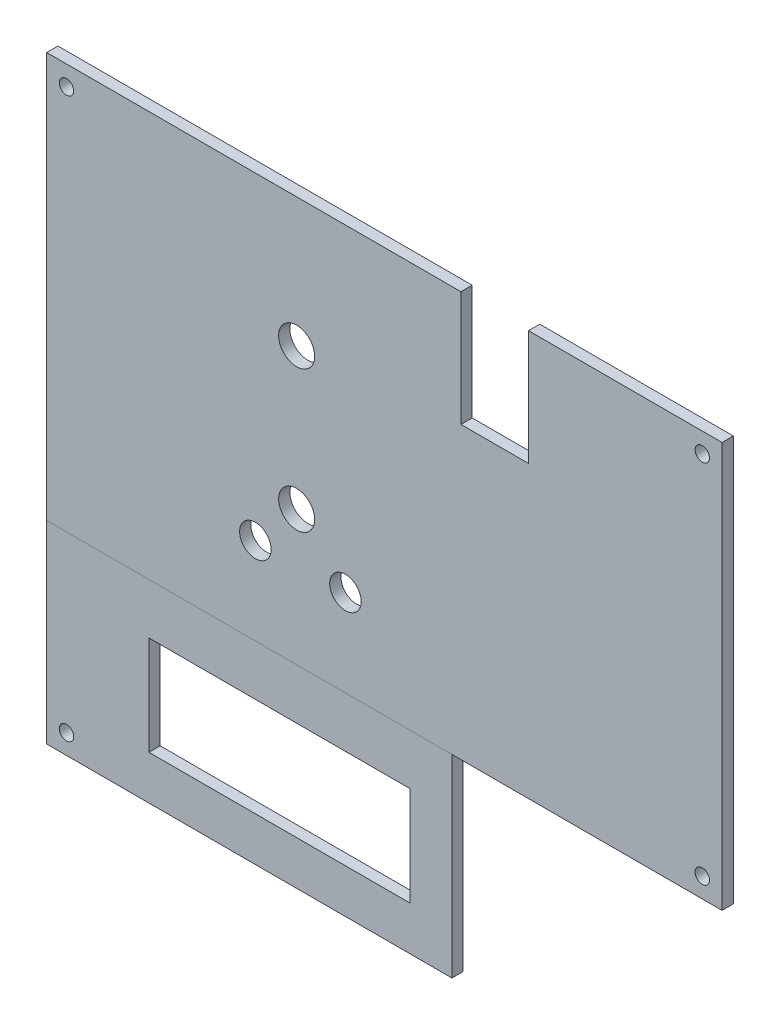
ISO-10303-21;
HEADER;
FILE_DESCRIPTION(('STEP AP214'),'2;1');
FILE_NAME('part.step','',(''),(''),'','','');
FILE_SCHEMA(('AUTOMOTIVE_DESIGN { 1 0 10303 214 1 1 1 1 }'));
ENDSEC;
DATA;
#1=APPLICATION_CONTEXT('core data for automotive mechanical design processes');
#2=APPLICATION_PROTOCOL_DEFINITION('international standard','automotive_design',2000,#1);
#3=PRODUCT_CONTEXT('',#1,'mechanical');
#4=PRODUCT('Part','Part','',(#3));
#5=PRODUCT_RELATED_PRODUCT_CATEGORY('part','',(#4));
#6=PRODUCT_DEFINITION_FORMATION('','',#4);
#7=PRODUCT_DEFINITION_CONTEXT('part definition',#1,'design');
#8=PRODUCT_DEFINITION('design','',#6,#7);
#9=PRODUCT_DEFINITION_SHAPE('','',#8);
#10=(LENGTH_UNIT() NAMED_UNIT(*) SI_UNIT(.MILLI.,.METRE.));
#11=(NAMED_UNIT(*) PLANE_ANGLE_UNIT() SI_UNIT($,.RADIAN.));
#12=(NAMED_UNIT(*) SI_UNIT($,.STERADIAN.) SOLID_ANGLE_UNIT());
#13=UNCERTAINTY_MEASURE_WITH_UNIT(LENGTH_MEASURE(1.E-05),#10,'distance_accuracy_value','');
#14=(GEOMETRIC_REPRESENTATION_CONTEXT(3) GLOBAL_UNCERTAINTY_ASSIGNED_CONTEXT((#13)) GLOBAL_UNIT_ASSIGNED_CONTEXT((#10,
#11,#12)) REPRESENTATION_CONTEXT('',''));
#15=CARTESIAN_POINT('',(0.,0.,0.));
#16=DIRECTION('',(0.,0.,1.));
#17=DIRECTION('',(1.,0.,0.));
#18=AXIS2_PLACEMENT_3D('',#15,#16,#17);
#19=CARTESIAN_POINT('',(-10.1855222715717,-9.29640000000001,0.));
#20=DIRECTION('',(-1.,0.,0.));
#21=DIRECTION('',(0.,-1.,0.));
#22=AXIS2_PLACEMENT_3D('',#19,#20,#21);
#23=PLANE('',#22);
#24=DIRECTION('',(0.,-1.,0.));
#25=VECTOR('',#24,1.);
#26=CARTESIAN_POINT('',(-10.1855222715717,-9.29640000000001,3.175));
#27=LINE('',#26,#25);
#28=CARTESIAN_POINT('',(-10.1855222715717,-9.29640000000001,3.175));
#29=VERTEX_POINT('',#28);
#30=CARTESIAN_POINT('',(-10.1855222715717,-63.9064,3.175));
#31=VERTEX_POINT('',#30);
#32=EDGE_CURVE('E153',#29,#31,#27,.T.);
#33=ORIENTED_EDGE('',*,*,#32,.F.);
#34=DIRECTION('',(0.,0.,1.));
#35=VECTOR('',#34,1.);
#36=CARTESIAN_POINT('',(-10.1855222715717,-9.29640000000001,0.));
#37=LINE('',#36,#35);
#38=CARTESIAN_POINT('',(-10.1855222715717,-9.29640000000001,0.));
#39=VERTEX_POINT('',#38);
#40=EDGE_CURVE('E12',#39,#29,#37,.T.);
#41=ORIENTED_EDGE('',*,*,#40,.F.);
#42=DIRECTION('',(0.,-1.,0.));
#43=VECTOR('',#42,1.);
#44=CARTESIAN_POINT('',(-10.1855222715717,-9.29640000000001,0.));
#45=LINE('',#44,#43);
#46=CARTESIAN_POINT('',(-10.1855222715717,-63.9064,0.));
#47=VERTEX_POINT('',#46);
#48=EDGE_CURVE('E157',#39,#47,#45,.T.);
#49=ORIENTED_EDGE('',*,*,#48,.T.);
#50=DIRECTION('',(0.,0.,1.));
#51=VECTOR('',#50,1.);
#52=CARTESIAN_POINT('',(-10.1855222715717,-63.9064,0.));
#53=LINE('',#52,#51);
#54=EDGE_CURVE('E54',#47,#31,#53,.T.);
#55=ORIENTED_EDGE('',*,*,#54,.T.);
#56=EDGE_LOOP('',(#33,#41,#49,#55));
#57=FACE_BOUND('',#56,.T.);
#58=ADVANCED_FACE('F51',(#57),#23,.T.);
#59=CARTESIAN_POINT('',(-10.1855222715717,-9.29640000000001,0.));
#60=DIRECTION('',(0.,1.,0.));
#61=DIRECTION('',(0.,0.,1.));
#62=AXIS2_PLACEMENT_3D('',#59,#60,#61);
#63=PLANE('',#62);
#64=DIRECTION('',(-1.,0.,0.));
#65=VECTOR('',#64,1.);
#66=CARTESIAN_POINT('',(-10.1855222715717,-9.29640000000001,3.175));
#67=LINE('',#66,#65);
#68=CARTESIAN_POINT('',(104.114477728428,-9.29640000000001,3.175));
#69=VERTEX_POINT('',#68);
#70=EDGE_CURVE('E161',#69,#29,#67,.T.);
#71=ORIENTED_EDGE('',*,*,#70,.F.);
#72=DIRECTION('',(0.,0.,1.));
#73=VECTOR('',#72,1.);
#74=CARTESIAN_POINT('',(104.114477728428,-9.29640000000001,0.));
#75=LINE('',#74,#73);
#76=CARTESIAN_POINT('',(104.114477728428,-9.29640000000001,0.));
#77=VERTEX_POINT('',#76);
#78=EDGE_CURVE('E59',#77,#69,#75,.T.);
#79=ORIENTED_EDGE('',*,*,#78,.F.);
#80=DIRECTION('',(-1.,0.,0.));
#81=VECTOR('',#80,1.);
#82=CARTESIAN_POINT('',(-10.1855222715717,-9.29640000000001,0.));
#83=LINE('',#82,#81);
#84=EDGE_CURVE('E167',#77,#39,#83,.T.);
#85=ORIENTED_EDGE('',*,*,#84,.T.);
#86=ORIENTED_EDGE('',*,*,#40,.T.);
#87=EDGE_LOOP('',(#71,#79,#85,#86));
#88=FACE_BOUND('',#87,.T.);
#89=ADVANCED_FACE('F193',(#88),#63,.T.);
#90=CARTESIAN_POINT('',(104.114477728428,-9.29640000000001,0.));
#91=DIRECTION('',(1.,0.,0.));
#92=DIRECTION('',(0.,0.,-1.));
#93=AXIS2_PLACEMENT_3D('',#90,#91,#92);
#94=PLANE('',#93);
#95=DIRECTION('',(0.,1.,0.));
#96=VECTOR('',#95,1.);
#97=CARTESIAN_POINT('',(104.114477728428,-9.29640000000001,3.175));
#98=LINE('',#97,#96);
#99=CARTESIAN_POINT('',(104.114477728428,-63.9064,3.175));
#100=VERTEX_POINT('',#99);
#101=EDGE_CURVE('E175',#100,#69,#98,.T.);
#102=ORIENTED_EDGE('',*,*,#101,.F.);
#103=DIRECTION('',(0.,0.,1.));
#104=VECTOR('',#103,1.);
#105=CARTESIAN_POINT('',(104.114477728428,-63.9064,0.));
#106=LINE('',#105,#104);
#107=CARTESIAN_POINT('',(104.114477728428,-63.9064,0.));
#108=VERTEX_POINT('',#107);
#109=EDGE_CURVE('E180',#108,#100,#106,.T.);
#110=ORIENTED_EDGE('',*,*,#109,.F.);
#111=DIRECTION('',(0.,1.,0.));
#112=VECTOR('',#111,1.);
#113=CARTESIAN_POINT('',(104.114477728428,-9.29640000000001,0.));
#114=LINE('',#113,#112);
#115=EDGE_CURVE('E164',#108,#77,#114,.T.);
#116=ORIENTED_EDGE('',*,*,#115,.T.);
#117=ORIENTED_EDGE('',*,*,#78,.T.);
#118=EDGE_LOOP('',(#102,#110,#116,#117));
#119=FACE_BOUND('',#118,.T.);
#120=ADVANCED_FACE('F197',(#119),#94,.T.);
#121=CARTESIAN_POINT('',(-10.1855222715717,-63.9064,0.));
#122=DIRECTION('',(0.,-1.,0.));
#123=DIRECTION('',(0.,0.,-1.));
#124=AXIS2_PLACEMENT_3D('',#121,#122,#123);
#125=PLANE('',#124);
#126=DIRECTION('',(1.,0.,0.));
#127=VECTOR('',#126,1.);
#128=CARTESIAN_POINT('',(-10.1855222715717,-63.9064,3.175));
#129=LINE('',#128,#127);
#130=EDGE_CURVE('E172',#31,#100,#129,.T.);
#131=ORIENTED_EDGE('',*,*,#130,.F.);
#132=ORIENTED_EDGE('',*,*,#54,.F.);
#133=DIRECTION('',(1.,0.,0.));
#134=VECTOR('',#133,1.);
#135=CARTESIAN_POINT('',(-10.1855222715717,-63.9064,0.));
#136=LINE('',#135,#134);
#137=EDGE_CURVE('E160',#47,#108,#136,.T.);
#138=ORIENTED_EDGE('',*,*,#137,.T.);
#139=ORIENTED_EDGE('',*,*,#109,.T.);
#140=EDGE_LOOP('',(#131,#132,#138,#139));
#141=FACE_BOUND('',#140,.T.);
#142=ADVANCED_FACE('F188',(#141),#125,.T.);
#143=CARTESIAN_POINT('',(0.,0.,0.));
#144=DIRECTION('',(0.,0.,1.));
#145=DIRECTION('',(1.,0.,0.));
#146=AXIS2_PLACEMENT_3D('',#143,#144,#145);
#147=PLANE('',#146);
#148=CARTESIAN_POINT('',(-4.59752227157175,-58.3184,0.));
#149=DIRECTION('',(0.,0.,1.));
#150=DIRECTION('',(1.,0.,0.));
#151=AXIS2_PLACEMENT_3D('',#148,#149,#150);
#152=CIRCLE('',#151,2.032);
#153=CARTESIAN_POINT('',(-2.56552227157176,-58.3184,0.));
#154=VERTEX_POINT('',#153);
#155=EDGE_CURVE('E147',#154,#154,#152,.T.);
#156=ORIENTED_EDGE('',*,*,#155,.T.);
#157=EDGE_LOOP('',(#156));
#158=FACE_BOUND('',#157,.T.);
#159=DIRECTION('',(-1.,0.,0.));
#160=VECTOR('',#159,1.);
#161=CARTESIAN_POINT('',(18.6411741669177,-23.5699071660705,0.));
#162=LINE('',#161,#160);
#163=CARTESIAN_POINT('',(92.3011741669177,-23.5699071660705,0.));
#164=VERTEX_POINT('',#163);
#165=CARTESIAN_POINT('',(18.6411741669177,-23.5699071660705,0.));
#166=VERTEX_POINT('',#165);
#167=EDGE_CURVE('E124',#164,#166,#162,.T.);
#168=ORIENTED_EDGE('',*,*,#167,.T.);
#169=DIRECTION('',(0.,-1.,0.));
#170=VECTOR('',#169,1.);
#171=CARTESIAN_POINT('',(18.6411741669177,-23.5699071660705,0.));
#172=LINE('',#171,#170);
#173=CARTESIAN_POINT('',(18.6411741669177,-51.5099071660705,0.));
#174=VERTEX_POINT('',#173);
#175=EDGE_CURVE('E118',#166,#174,#172,.T.);
#176=ORIENTED_EDGE('',*,*,#175,.T.);
#177=DIRECTION('',(1.,0.,0.));
#178=VECTOR('',#177,1.);
#179=CARTESIAN_POINT('',(18.6411741669177,-51.5099071660705,0.));
#180=LINE('',#179,#178);
#181=CARTESIAN_POINT('',(92.3011741669176,-51.5099071660705,0.));
#182=VERTEX_POINT('',#181);
#183=EDGE_CURVE('E127',#174,#182,#180,.T.);
#184=ORIENTED_EDGE('',*,*,#183,.T.);
#185=DIRECTION('',(0.,1.,0.));
#186=VECTOR('',#185,1.);
#187=CARTESIAN_POINT('',(92.3011741669177,-23.5699071660705,0.));
#188=LINE('',#187,#186);
#189=EDGE_CURVE('E67',#182,#164,#188,.T.);
#190=ORIENTED_EDGE('',*,*,#189,.T.);
#191=EDGE_LOOP('',(#168,#176,#184,#190));
#192=FACE_BOUND('',#191,.T.);
#193=ORIENTED_EDGE('',*,*,#48,.F.);
#194=ORIENTED_EDGE('',*,*,#84,.F.);
#195=ORIENTED_EDGE('',*,*,#115,.F.);
#196=ORIENTED_EDGE('',*,*,#137,.F.);
#197=EDGE_LOOP('',(#193,#194,#195,#196));
#198=FACE_BOUND('',#197,.T.);
#199=ADVANCED_FACE('F131',(#158,#192,#198),#147,.F.);
#200=CARTESIAN_POINT('',(0.,0.,3.175));
#201=DIRECTION('',(0.,0.,1.));
#202=DIRECTION('',(1.,0.,0.));
#203=AXIS2_PLACEMENT_3D('',#200,#201,#202);
#204=PLANE('',#203);
#205=CARTESIAN_POINT('',(-4.59752227157175,-58.3184,3.175));
#206=DIRECTION('',(0.,0.,1.));
#207=DIRECTION('',(1.,0.,0.));
#208=AXIS2_PLACEMENT_3D('',#205,#206,#207);
#209=CIRCLE('',#208,2.032);
#210=CARTESIAN_POINT('',(-2.56552227157176,-58.3184,3.175));
#211=VERTEX_POINT('',#210);
#212=EDGE_CURVE('E140',#211,#211,#209,.T.);
#213=ORIENTED_EDGE('',*,*,#212,.F.);
#214=EDGE_LOOP('',(#213));
#215=FACE_BOUND('',#214,.T.);
#216=DIRECTION('',(0.,-1.,0.));
#217=VECTOR('',#216,1.);
#218=CARTESIAN_POINT('',(18.6411741669177,-23.5699071660705,3.175));
#219=LINE('',#218,#217);
#220=CARTESIAN_POINT('',(18.6411741669177,-23.5699071660705,3.175));
#221=VERTEX_POINT('',#220);
#222=CARTESIAN_POINT('',(18.6411741669177,-51.5099071660705,3.175));
#223=VERTEX_POINT('',#222);
#224=EDGE_CURVE('E75',#221,#223,#219,.T.);
#225=ORIENTED_EDGE('',*,*,#224,.F.);
#226=DIRECTION('',(-1.,0.,0.));
#227=VECTOR('',#226,1.);
#228=CARTESIAN_POINT('',(18.6411741669177,-23.5699071660705,3.175));
#229=LINE('',#228,#227);
#230=CARTESIAN_POINT('',(92.3011741669177,-23.5699071660705,3.175));
#231=VERTEX_POINT('',#230);
#232=EDGE_CURVE('E134',#231,#221,#229,.T.);
#233=ORIENTED_EDGE('',*,*,#232,.F.);
#234=DIRECTION('',(0.,1.,0.));
#235=VECTOR('',#234,1.);
#236=CARTESIAN_POINT('',(92.3011741669177,-23.5699071660705,3.175));
#237=LINE('',#236,#235);
#238=CARTESIAN_POINT('',(92.3011741669176,-51.5099071660705,3.175));
#239=VERTEX_POINT('',#238);
#240=EDGE_CURVE('E137',#239,#231,#237,.T.);
#241=ORIENTED_EDGE('',*,*,#240,.F.);
#242=DIRECTION('',(1.,0.,0.));
#243=VECTOR('',#242,1.);
#244=CARTESIAN_POINT('',(18.6411741669177,-51.5099071660705,3.175));
#245=LINE('',#244,#243);
#246=EDGE_CURVE('E146',#223,#239,#245,.T.);
#247=ORIENTED_EDGE('',*,*,#246,.F.);
#248=EDGE_LOOP('',(#225,#233,#241,#247));
#249=FACE_BOUND('',#248,.T.);
#250=ORIENTED_EDGE('',*,*,#32,.T.);
#251=ORIENTED_EDGE('',*,*,#130,.T.);
#252=ORIENTED_EDGE('',*,*,#101,.T.);
#253=ORIENTED_EDGE('',*,*,#70,.T.);
#254=EDGE_LOOP('',(#250,#251,#252,#253));
#255=FACE_BOUND('',#254,.T.);
#256=ADVANCED_FACE('F190',(#215,#249,#255),#204,.T.);
#257=CARTESIAN_POINT('',(18.6411741669177,-23.5699071660705,0.));
#258=DIRECTION('',(-1.,0.,0.));
#259=DIRECTION('',(0.,0.,1.));
#260=AXIS2_PLACEMENT_3D('',#257,#258,#259);
#261=PLANE('',#260);
#262=ORIENTED_EDGE('',*,*,#224,.T.);
#263=DIRECTION('',(0.,0.,1.));
#264=VECTOR('',#263,1.);
#265=CARTESIAN_POINT('',(18.6411741669177,-51.5099071660705,0.));
#266=LINE('',#265,#264);
#267=EDGE_CURVE('E114',#174,#223,#266,.T.);
#268=ORIENTED_EDGE('',*,*,#267,.F.);
#269=ORIENTED_EDGE('',*,*,#175,.F.);
#270=DIRECTION('',(0.,0.,1.));
#271=VECTOR('',#270,1.);
#272=CARTESIAN_POINT('',(18.6411741669177,-23.5699071660705,0.));
#273=LINE('',#272,#271);
#274=EDGE_CURVE('E151',#166,#221,#273,.T.);
#275=ORIENTED_EDGE('',*,*,#274,.T.);
#276=EDGE_LOOP('',(#262,#268,#269,#275));
#277=FACE_BOUND('',#276,.T.);
#278=ADVANCED_FACE('F116',(#277),#261,.F.);
#279=CARTESIAN_POINT('',(18.6411741669177,-23.5699071660705,0.));
#280=DIRECTION('',(0.,1.,0.));
#281=DIRECTION('',(0.,0.,1.));
#282=AXIS2_PLACEMENT_3D('',#279,#280,#281);
#283=PLANE('',#282);
#284=ORIENTED_EDGE('',*,*,#232,.T.);
#285=ORIENTED_EDGE('',*,*,#274,.F.);
#286=ORIENTED_EDGE('',*,*,#167,.F.);
#287=DIRECTION('',(0.,0.,1.));
#288=VECTOR('',#287,1.);
#289=CARTESIAN_POINT('',(92.3011741669177,-23.5699071660705,0.));
#290=LINE('',#289,#288);
#291=EDGE_CURVE('E154',#164,#231,#290,.T.);
#292=ORIENTED_EDGE('',*,*,#291,.T.);
#293=EDGE_LOOP('',(#284,#285,#286,#292));
#294=FACE_BOUND('',#293,.T.);
#295=ADVANCED_FACE('F233',(#294),#283,.F.);
#296=CARTESIAN_POINT('',(92.3011741669177,-23.5699071660705,0.));
#297=DIRECTION('',(1.,0.,0.));
#298=DIRECTION('',(0.,1.,0.));
#299=AXIS2_PLACEMENT_3D('',#296,#297,#298);
#300=PLANE('',#299);
#301=ORIENTED_EDGE('',*,*,#240,.T.);
#302=ORIENTED_EDGE('',*,*,#291,.F.);
#303=ORIENTED_EDGE('',*,*,#189,.F.);
#304=DIRECTION('',(0.,0.,1.));
#305=VECTOR('',#304,1.);
#306=CARTESIAN_POINT('',(92.3011741669176,-51.5099071660705,0.));
#307=LINE('',#306,#305);
#308=EDGE_CURVE('E123',#182,#239,#307,.T.);
#309=ORIENTED_EDGE('',*,*,#308,.T.);
#310=EDGE_LOOP('',(#301,#302,#303,#309));
#311=FACE_BOUND('',#310,.T.);
#312=ADVANCED_FACE('F244',(#311),#300,.F.);
#313=CARTESIAN_POINT('',(18.6411741669177,-51.5099071660705,0.));
#314=DIRECTION('',(0.,-1.,0.));
#315=DIRECTION('',(1.,0.,0.));
#316=AXIS2_PLACEMENT_3D('',#313,#314,#315);
#317=PLANE('',#316);
#318=ORIENTED_EDGE('',*,*,#246,.T.);
#319=ORIENTED_EDGE('',*,*,#308,.F.);
#320=ORIENTED_EDGE('',*,*,#183,.F.);
#321=ORIENTED_EDGE('',*,*,#267,.T.);
#322=EDGE_LOOP('',(#318,#319,#320,#321));
#323=FACE_BOUND('',#322,.T.);
#324=ADVANCED_FACE('F128',(#323),#317,.F.);
#325=CARTESIAN_POINT('',(-4.59752227157175,-58.3184,0.));
#326=DIRECTION('',(0.,0.,1.));
#327=DIRECTION('',(1.,0.,0.));
#328=AXIS2_PLACEMENT_3D('',#325,#326,#327);
#329=CYLINDRICAL_SURFACE('',#328,2.032);
#330=ORIENTED_EDGE('',*,*,#155,.F.);
#331=EDGE_LOOP('',(#330));
#332=FACE_BOUND('',#331,.T.);
#333=ORIENTED_EDGE('',*,*,#212,.T.);
#334=EDGE_LOOP('',(#333));
#335=FACE_BOUND('',#334,.T.);
#336=ADVANCED_FACE('F262',(#332,#335),#329,.F.);
#337=CLOSED_SHELL('',(#58,#89,#120,#142,#199,#256,#278,#295,#312,#324,#336));
#338=MANIFOLD_SOLID_BREP('B2',#337);
#339=CARTESIAN_POINT('',(106.654477728428,0.,3.175));
#340=DIRECTION('',(1.,0.,0.));
#341=DIRECTION('',(0.,0.,-1.));
#342=AXIS2_PLACEMENT_3D('',#339,#340,#341);
#343=PLANE('',#342);
#344=DIRECTION('',(0.,-1.,0.));
#345=VECTOR('',#344,1.);
#346=CARTESIAN_POINT('',(106.654477728428,0.,0.));
#347=LINE('',#346,#345);
#348=CARTESIAN_POINT('',(106.654477728428,105.0036,0.));
#349=VERTEX_POINT('',#348);
#350=CARTESIAN_POINT('',(106.654477728428,72.5729197424779,0.));
#351=VERTEX_POINT('',#350);
#352=EDGE_CURVE('E475',#349,#351,#347,.T.);
#353=ORIENTED_EDGE('',*,*,#352,.F.);
#354=DIRECTION('',(0.,0.,-1.));
#355=VECTOR('',#354,1.);
#356=CARTESIAN_POINT('',(106.654477728428,105.0036,3.175));
#357=LINE('',#356,#355);
#358=CARTESIAN_POINT('',(106.654477728428,105.0036,3.175));
#359=VERTEX_POINT('',#358);
#360=EDGE_CURVE('E49',#359,#349,#357,.T.);
#361=ORIENTED_EDGE('',*,*,#360,.F.);
#362=DIRECTION('',(0.,-1.,0.));
#363=VECTOR('',#362,1.);
#364=CARTESIAN_POINT('',(106.654477728428,0.,3.175));
#365=LINE('',#364,#363);
#366=CARTESIAN_POINT('',(106.654477728428,72.5729197424779,3.175));
#367=VERTEX_POINT('',#366);
#368=EDGE_CURVE('E407',#359,#367,#365,.T.);
#369=ORIENTED_EDGE('',*,*,#368,.T.);
#370=DIRECTION('',(0.,0.,-1.));
#371=VECTOR('',#370,1.);
#372=CARTESIAN_POINT('',(106.654477728428,72.5729197424779,3.175));
#373=LINE('',#372,#371);
#374=EDGE_CURVE('E355',#367,#351,#373,.T.);
#375=ORIENTED_EDGE('',*,*,#374,.T.);
#376=EDGE_LOOP('',(#353,#361,#369,#375));
#377=FACE_BOUND('',#376,.T.);
#378=ADVANCED_FACE('F302',(#377),#343,.T.);
#379=CARTESIAN_POINT('',(0.,105.0036,3.175));
#380=DIRECTION('',(0.,1.,0.));
#381=DIRECTION('',(0.,0.,1.));
#382=AXIS2_PLACEMENT_3D('',#379,#380,#381);
#383=PLANE('',#382);
#384=DIRECTION('',(1.,0.,0.));
#385=VECTOR('',#384,1.);
#386=CARTESIAN_POINT('',(0.,105.0036,0.));
#387=LINE('',#386,#385);
#388=CARTESIAN_POINT('',(-10.1855222715718,105.0036,0.));
#389=VERTEX_POINT('',#388);
#390=EDGE_CURVE('E478',#389,#349,#387,.T.);
#391=ORIENTED_EDGE('',*,*,#390,.F.);
#392=DIRECTION('',(0.,0.,-1.));
#393=VECTOR('',#392,1.);
#394=CARTESIAN_POINT('',(-10.1855222715718,105.0036,3.175));
#395=LINE('',#394,#393);
#396=CARTESIAN_POINT('',(-10.1855222715718,105.0036,3.175));
#397=VERTEX_POINT('',#396);
#398=EDGE_CURVE('E312',#397,#389,#395,.T.);
#399=ORIENTED_EDGE('',*,*,#398,.F.);
#400=DIRECTION('',(1.,0.,0.));
#401=VECTOR('',#400,1.);
#402=CARTESIAN_POINT('',(0.,105.0036,3.175));
#403=LINE('',#402,#401);
#404=EDGE_CURVE('E398',#397,#359,#403,.T.);
#405=ORIENTED_EDGE('',*,*,#404,.T.);
#406=ORIENTED_EDGE('',*,*,#360,.T.);
#407=EDGE_LOOP('',(#391,#399,#405,#406));
#408=FACE_BOUND('',#407,.T.);
#409=ADVANCED_FACE('F519',(#408),#383,.T.);
#410=CARTESIAN_POINT('',(-10.1855222715717,0.,3.175));
#411=DIRECTION('',(1.,0.,0.));
#412=DIRECTION('',(0.,1.,0.));
#413=AXIS2_PLACEMENT_3D('',#410,#411,#412);
#414=PLANE('',#413);
#415=DIRECTION('',(0.,-1.,0.));
#416=VECTOR('',#415,1.);
#417=CARTESIAN_POINT('',(-10.1855222715717,0.,0.));
#418=LINE('',#417,#416);
#419=CARTESIAN_POINT('',(-10.1855222715717,-9.29640000000001,0.));
#420=VERTEX_POINT('',#419);
#421=EDGE_CURVE('E482',#389,#420,#418,.T.);
#422=ORIENTED_EDGE('',*,*,#421,.T.);
#423=DIRECTION('',(0.,0.,-1.));
#424=VECTOR('',#423,1.);
#425=CARTESIAN_POINT('',(-10.1855222715717,-9.29640000000001,3.175));
#426=LINE('',#425,#424);
#427=CARTESIAN_POINT('',(-10.1855222715717,-9.29640000000001,3.175));
#428=VERTEX_POINT('',#427);
#429=EDGE_CURVE('E508',#428,#420,#426,.T.);
#430=ORIENTED_EDGE('',*,*,#429,.F.);
#431=DIRECTION('',(0.,-1.,0.));
#432=VECTOR('',#431,1.);
#433=CARTESIAN_POINT('',(-10.1855222715717,0.,3.175));
#434=LINE('',#433,#432);
#435=EDGE_CURVE('E406',#397,#428,#434,.T.);
#436=ORIENTED_EDGE('',*,*,#435,.F.);
#437=ORIENTED_EDGE('',*,*,#398,.T.);
#438=EDGE_LOOP('',(#422,#430,#436,#437));
#439=FACE_BOUND('',#438,.T.);
#440=ADVANCED_FACE('F515',(#439),#414,.F.);
#441=CARTESIAN_POINT('',(0.,-9.29640000000001,3.175));
#442=DIRECTION('',(0.,1.,0.));
#443=DIRECTION('',(-1.,0.,0.));
#444=AXIS2_PLACEMENT_3D('',#441,#442,#443);
#445=PLANE('',#444);
#446=DIRECTION('',(1.,0.,0.));
#447=VECTOR('',#446,1.);
#448=CARTESIAN_POINT('',(0.,-9.29640000000001,0.));
#449=LINE('',#448,#447);
#450=CARTESIAN_POINT('',(180.314477728428,-9.29640000000001,0.));
#451=VERTEX_POINT('',#450);
#452=EDGE_CURVE('E486',#420,#451,#449,.T.);
#453=ORIENTED_EDGE('',*,*,#452,.T.);
#454=DIRECTION('',(0.,0.,-1.));
#455=VECTOR('',#454,1.);
#456=CARTESIAN_POINT('',(180.314477728428,-9.29640000000001,3.175));
#457=LINE('',#456,#455);
#458=CARTESIAN_POINT('',(180.314477728428,-9.29640000000001,3.175));
#459=VERTEX_POINT('',#458);
#460=EDGE_CURVE('E505',#459,#451,#457,.T.);
#461=ORIENTED_EDGE('',*,*,#460,.F.);
#462=DIRECTION('',(1.,0.,0.));
#463=VECTOR('',#462,1.);
#464=CARTESIAN_POINT('',(0.,-9.29640000000001,3.175));
#465=LINE('',#464,#463);
#466=EDGE_CURVE('E400',#428,#459,#465,.T.);
#467=ORIENTED_EDGE('',*,*,#466,.F.);
#468=ORIENTED_EDGE('',*,*,#429,.T.);
#469=EDGE_LOOP('',(#453,#461,#467,#468));
#470=FACE_BOUND('',#469,.T.);
#471=ADVANCED_FACE('F576',(#470),#445,.F.);
#472=CARTESIAN_POINT('',(180.314477728428,0.,3.175));
#473=DIRECTION('',(1.,0.,0.));
#474=DIRECTION('',(0.,0.,-1.));
#475=AXIS2_PLACEMENT_3D('',#472,#473,#474);
#476=PLANE('',#475);
#477=DIRECTION('',(0.,-1.,0.));
#478=VECTOR('',#477,1.);
#479=CARTESIAN_POINT('',(180.314477728428,0.,0.));
#480=LINE('',#479,#478);
#481=CARTESIAN_POINT('',(180.314477728428,105.0036,0.));
#482=VERTEX_POINT('',#481);
#483=EDGE_CURVE('E490',#482,#451,#480,.T.);
#484=ORIENTED_EDGE('',*,*,#483,.F.);
#485=DIRECTION('',(0.,0.,-1.));
#486=VECTOR('',#485,1.);
#487=CARTESIAN_POINT('',(180.314477728428,105.0036,3.175));
#488=LINE('',#487,#486);
#489=CARTESIAN_POINT('',(180.314477728428,105.0036,3.175));
#490=VERTEX_POINT('',#489);
#491=EDGE_CURVE('E384',#490,#482,#488,.T.);
#492=ORIENTED_EDGE('',*,*,#491,.F.);
#493=DIRECTION('',(0.,-1.,0.));
#494=VECTOR('',#493,1.);
#495=CARTESIAN_POINT('',(180.314477728428,0.,3.175));
#496=LINE('',#495,#494);
#497=EDGE_CURVE('E395',#490,#459,#496,.T.);
#498=ORIENTED_EDGE('',*,*,#497,.T.);
#499=ORIENTED_EDGE('',*,*,#460,.T.);
#500=EDGE_LOOP('',(#484,#492,#498,#499));
#501=FACE_BOUND('',#500,.T.);
#502=ADVANCED_FACE('F574',(#501),#476,.T.);
#503=CARTESIAN_POINT('',(125.704477728428,105.0036,0.));
#504=VERTEX_POINT('',#503);
#505=EDGE_CURVE('E380',#504,#482,#387,.T.);
#506=ORIENTED_EDGE('',*,*,#505,.F.);
#507=DIRECTION('',(0.,0.,-1.));
#508=VECTOR('',#507,1.);
#509=CARTESIAN_POINT('',(125.704477728428,105.0036,3.175));
#510=LINE('',#509,#508);
#511=CARTESIAN_POINT('',(125.704477728428,105.0036,3.175));
#512=VERTEX_POINT('',#511);
#513=EDGE_CURVE('E374',#512,#504,#510,.T.);
#514=ORIENTED_EDGE('',*,*,#513,.F.);
#515=EDGE_CURVE('E378',#512,#490,#403,.T.);
#516=ORIENTED_EDGE('',*,*,#515,.T.);
#517=ORIENTED_EDGE('',*,*,#491,.T.);
#518=EDGE_LOOP('',(#506,#514,#516,#517));
#519=FACE_BOUND('',#518,.T.);
#520=ADVANCED_FACE('F376',(#519),#383,.T.);
#521=CARTESIAN_POINT('',(125.704477728428,0.,3.175));
#522=DIRECTION('',(1.,0.,0.));
#523=DIRECTION('',(0.,0.,-1.));
#524=AXIS2_PLACEMENT_3D('',#521,#522,#523);
#525=PLANE('',#524);
#526=DIRECTION('',(0.,-1.,0.));
#527=VECTOR('',#526,1.);
#528=CARTESIAN_POINT('',(125.704477728428,0.,0.));
#529=LINE('',#528,#527);
#530=CARTESIAN_POINT('',(125.704477728428,72.5729197424779,0.));
#531=VERTEX_POINT('',#530);
#532=EDGE_CURVE('E494',#504,#531,#529,.T.);
#533=ORIENTED_EDGE('',*,*,#532,.T.);
#534=DIRECTION('',(0.,0.,-1.));
#535=VECTOR('',#534,1.);
#536=CARTESIAN_POINT('',(125.704477728428,72.5729197424779,3.175));
#537=LINE('',#536,#535);
#538=CARTESIAN_POINT('',(125.704477728428,72.5729197424779,3.175));
#539=VERTEX_POINT('',#538);
#540=EDGE_CURVE('E385',#539,#531,#537,.T.);
#541=ORIENTED_EDGE('',*,*,#540,.F.);
#542=DIRECTION('',(0.,-1.,0.));
#543=VECTOR('',#542,1.);
#544=CARTESIAN_POINT('',(125.704477728428,0.,3.175));
#545=LINE('',#544,#543);
#546=EDGE_CURVE('E388',#512,#539,#545,.T.);
#547=ORIENTED_EDGE('',*,*,#546,.F.);
#548=ORIENTED_EDGE('',*,*,#513,.T.);
#549=EDGE_LOOP('',(#533,#541,#547,#548));
#550=FACE_BOUND('',#549,.T.);
#551=ADVANCED_FACE('F389',(#550),#525,.F.);
#552=CARTESIAN_POINT('',(60.325,68.58,3.175));
#553=DIRECTION('',(0.,0.,-1.));
#554=DIRECTION('',(-1.,0.,0.));
#555=AXIS2_PLACEMENT_3D('',#552,#553,#554);
#556=CYLINDRICAL_SURFACE('',#555,5.08);
#557=CARTESIAN_POINT('',(60.325,68.58,3.175));
#558=DIRECTION('',(0.,0.,1.));
#559=DIRECTION('',(1.,0.,0.));
#560=AXIS2_PLACEMENT_3D('',#557,#558,#559);
#561=CIRCLE('',#560,5.08);
#562=CARTESIAN_POINT('',(65.405,68.58,3.175));
#563=VERTEX_POINT('',#562);
#564=EDGE_CURVE('E413',#563,#563,#561,.T.);
#565=ORIENTED_EDGE('',*,*,#564,.T.);
#566=EDGE_LOOP('',(#565));
#567=FACE_BOUND('',#566,.T.);
#568=CARTESIAN_POINT('',(60.325,68.58,0.));
#569=DIRECTION('',(0.,0.,1.));
#570=DIRECTION('',(1.,0.,0.));
#571=AXIS2_PLACEMENT_3D('',#568,#569,#570);
#572=CIRCLE('',#571,5.08);
#573=CARTESIAN_POINT('',(65.405,68.58,0.));
#574=VERTEX_POINT('',#573);
#575=EDGE_CURVE('E471',#574,#574,#572,.T.);
#576=ORIENTED_EDGE('',*,*,#575,.F.);
#577=EDGE_LOOP('',(#576));
#578=FACE_BOUND('',#577,.T.);
#579=ADVANCED_FACE('F529',(#567,#578),#556,.F.);
#580=CARTESIAN_POINT('',(60.325,28.702,3.175));
#581=DIRECTION('',(0.,0.,-1.));
#582=DIRECTION('',(-1.,0.,0.));
#583=AXIS2_PLACEMENT_3D('',#580,#581,#582);
#584=CYLINDRICAL_SURFACE('',#583,5.08);
#585=CARTESIAN_POINT('',(60.325,28.702,3.175));
#586=DIRECTION('',(0.,0.,1.));
#587=DIRECTION('',(1.,0.,0.));
#588=AXIS2_PLACEMENT_3D('',#585,#586,#587);
#589=CIRCLE('',#588,5.08);
#590=CARTESIAN_POINT('',(65.405,28.702,3.175));
#591=VERTEX_POINT('',#590);
#592=EDGE_CURVE('E416',#591,#591,#589,.T.);
#593=ORIENTED_EDGE('',*,*,#592,.T.);
#594=EDGE_LOOP('',(#593));
#595=FACE_BOUND('',#594,.T.);
#596=CARTESIAN_POINT('',(60.325,28.702,0.));
#597=DIRECTION('',(0.,0.,1.));
#598=DIRECTION('',(1.,0.,0.));
#599=AXIS2_PLACEMENT_3D('',#596,#597,#598);
#600=CIRCLE('',#599,5.08);
#601=CARTESIAN_POINT('',(65.405,28.702,0.));
#602=VERTEX_POINT('',#601);
#603=EDGE_CURVE('E464',#602,#602,#600,.T.);
#604=ORIENTED_EDGE('',*,*,#603,.F.);
#605=EDGE_LOOP('',(#604));
#606=FACE_BOUND('',#605,.T.);
#607=ADVANCED_FACE('F532',(#595,#606),#584,.F.);
#608=CARTESIAN_POINT('',(48.6791,15.24,3.175));
#609=DIRECTION('',(0.,0.,-1.));
#610=DIRECTION('',(-1.,0.,0.));
#611=AXIS2_PLACEMENT_3D('',#608,#609,#610);
#612=CYLINDRICAL_SURFACE('',#611,4.445);
#613=CARTESIAN_POINT('',(48.6791,15.24,3.175));
#614=DIRECTION('',(0.,0.,1.));
#615=DIRECTION('',(1.,0.,0.));
#616=AXIS2_PLACEMENT_3D('',#613,#614,#615);
#617=CIRCLE('',#616,4.445);
#618=CARTESIAN_POINT('',(53.1241,15.24,3.175));
#619=VERTEX_POINT('',#618);
#620=EDGE_CURVE('E422',#619,#619,#617,.T.);
#621=ORIENTED_EDGE('',*,*,#620,.T.);
#622=EDGE_LOOP('',(#621));
#623=FACE_BOUND('',#622,.T.);
#624=CARTESIAN_POINT('',(48.6791,15.24,0.));
#625=DIRECTION('',(0.,0.,1.));
#626=DIRECTION('',(1.,0.,0.));
#627=AXIS2_PLACEMENT_3D('',#624,#625,#626);
#628=CIRCLE('',#627,4.445);
#629=CARTESIAN_POINT('',(53.1241,15.24,0.));
#630=VERTEX_POINT('',#629);
#631=EDGE_CURVE('E458',#630,#630,#628,.T.);
#632=ORIENTED_EDGE('',*,*,#631,.F.);
#633=EDGE_LOOP('',(#632));
#634=FACE_BOUND('',#633,.T.);
#635=ADVANCED_FACE('F535',(#623,#634),#612,.F.);
#636=CARTESIAN_POINT('',(74.0791,15.24,3.175));
#637=DIRECTION('',(0.,0.,-1.));
#638=DIRECTION('',(-1.,0.,0.));
#639=AXIS2_PLACEMENT_3D('',#636,#637,#638);
#640=CYLINDRICAL_SURFACE('',#639,4.445);
#641=CARTESIAN_POINT('',(74.0791,15.24,3.175));
#642=DIRECTION('',(0.,0.,1.));
#643=DIRECTION('',(1.,0.,0.));
#644=AXIS2_PLACEMENT_3D('',#641,#642,#643);
#645=CIRCLE('',#644,4.445);
#646=CARTESIAN_POINT('',(78.5241,15.24,3.175));
#647=VERTEX_POINT('',#646);
#648=EDGE_CURVE('E426',#647,#647,#645,.T.);
#649=ORIENTED_EDGE('',*,*,#648,.T.);
#650=EDGE_LOOP('',(#649));
#651=FACE_BOUND('',#650,.T.);
#652=CARTESIAN_POINT('',(74.0791,15.24,0.));
#653=DIRECTION('',(0.,0.,1.));
#654=DIRECTION('',(1.,0.,0.));
#655=AXIS2_PLACEMENT_3D('',#652,#653,#654);
#656=CIRCLE('',#655,4.445);
#657=CARTESIAN_POINT('',(78.5241,15.24,0.));
#658=VERTEX_POINT('',#657);
#659=EDGE_CURVE('E453',#658,#658,#656,.T.);
#660=ORIENTED_EDGE('',*,*,#659,.F.);
#661=EDGE_LOOP('',(#660));
#662=FACE_BOUND('',#661,.T.);
#663=ADVANCED_FACE('F304',(#651,#662),#640,.F.);
#664=CARTESIAN_POINT('',(0.,72.5729197424779,3.175));
#665=DIRECTION('',(0.,-1.,0.));
#666=DIRECTION('',(0.,0.,-1.));
#667=AXIS2_PLACEMENT_3D('',#664,#665,#666);
#668=PLANE('',#667);
#669=DIRECTION('',(-1.,0.,0.));
#670=VECTOR('',#669,1.);
#671=CARTESIAN_POINT('',(0.,72.5729197424779,0.));
#672=LINE('',#671,#670);
#673=EDGE_CURVE('E348',#531,#351,#672,.T.);
#674=ORIENTED_EDGE('',*,*,#673,.T.);
#675=ORIENTED_EDGE('',*,*,#374,.F.);
#676=DIRECTION('',(-1.,0.,0.));
#677=VECTOR('',#676,1.);
#678=CARTESIAN_POINT('',(0.,72.5729197424779,3.175));
#679=LINE('',#678,#677);
#680=EDGE_CURVE('E320',#539,#367,#679,.T.);
#681=ORIENTED_EDGE('',*,*,#680,.F.);
#682=ORIENTED_EDGE('',*,*,#540,.T.);
#683=EDGE_LOOP('',(#674,#675,#681,#682));
#684=FACE_BOUND('',#683,.T.);
#685=ADVANCED_FACE('F542',(#684),#668,.F.);
#686=CARTESIAN_POINT('',(0.,0.,3.175));
#687=DIRECTION('',(0.,0.,1.));
#688=DIRECTION('',(1.,0.,0.));
#689=AXIS2_PLACEMENT_3D('',#686,#687,#688);
#690=PLANE('',#689);
#691=CARTESIAN_POINT('',(-4.59752227157175,99.4156,3.175));
#692=DIRECTION('',(0.,0.,1.));
#693=DIRECTION('',(1.,0.,0.));
#694=AXIS2_PLACEMENT_3D('',#691,#692,#693);
#695=CIRCLE('',#694,2.032);
#696=CARTESIAN_POINT('',(-2.56552227157175,99.4156,3.175));
#697=VERTEX_POINT('',#696);
#698=EDGE_CURVE('E446',#697,#697,#695,.T.);
#699=ORIENTED_EDGE('',*,*,#698,.F.);
#700=EDGE_LOOP('',(#699));
#701=FACE_BOUND('',#700,.T.);
#702=CARTESIAN_POINT('',(174.726477728428,99.4156,3.175));
#703=DIRECTION('',(0.,0.,1.));
#704=DIRECTION('',(1.,0.,0.));
#705=AXIS2_PLACEMENT_3D('',#702,#703,#704);
#706=CIRCLE('',#705,2.03200000000001);
#707=CARTESIAN_POINT('',(176.758477728428,99.4156,3.175));
#708=VERTEX_POINT('',#707);
#709=EDGE_CURVE('E438',#708,#708,#706,.T.);
#710=ORIENTED_EDGE('',*,*,#709,.F.);
#711=EDGE_LOOP('',(#710));
#712=FACE_BOUND('',#711,.T.);
#713=CARTESIAN_POINT('',(174.726477728428,-3.70840000000001,3.175));
#714=DIRECTION('',(0.,0.,1.));
#715=DIRECTION('',(1.,0.,0.));
#716=AXIS2_PLACEMENT_3D('',#713,#714,#715);
#717=CIRCLE('',#716,2.03200000000001);
#718=CARTESIAN_POINT('',(176.758477728428,-3.70840000000001,3.175));
#719=VERTEX_POINT('',#718);
#720=EDGE_CURVE('E430',#719,#719,#717,.T.);
#721=ORIENTED_EDGE('',*,*,#720,.F.);
#722=EDGE_LOOP('',(#721));
#723=FACE_BOUND('',#722,.T.);
#724=ORIENTED_EDGE('',*,*,#648,.F.);
#725=EDGE_LOOP('',(#724));
#726=FACE_BOUND('',#725,.T.);
#727=ORIENTED_EDGE('',*,*,#620,.F.);
#728=EDGE_LOOP('',(#727));
#729=FACE_BOUND('',#728,.T.);
#730=ORIENTED_EDGE('',*,*,#592,.F.);
#731=EDGE_LOOP('',(#730));
#732=FACE_BOUND('',#731,.T.);
#733=ORIENTED_EDGE('',*,*,#564,.F.);
#734=EDGE_LOOP('',(#733));
#735=FACE_BOUND('',#734,.T.);
#736=ORIENTED_EDGE('',*,*,#368,.F.);
#737=ORIENTED_EDGE('',*,*,#404,.F.);
#738=ORIENTED_EDGE('',*,*,#435,.T.);
#739=ORIENTED_EDGE('',*,*,#466,.T.);
#740=ORIENTED_EDGE('',*,*,#497,.F.);
#741=ORIENTED_EDGE('',*,*,#515,.F.);
#742=ORIENTED_EDGE('',*,*,#546,.T.);
#743=ORIENTED_EDGE('',*,*,#680,.T.);
#744=EDGE_LOOP('',(#736,#737,#738,#739,#740,#741,#742,#743));
#745=FACE_BOUND('',#744,.T.);
#746=ADVANCED_FACE('F393',(#701,#712,#723,#726,#729,#732,#735,#745),#690,.T.);
#747=CARTESIAN_POINT('',(0.,0.,0.));
#748=DIRECTION('',(0.,0.,1.));
#749=DIRECTION('',(1.,0.,0.));
#750=AXIS2_PLACEMENT_3D('',#747,#748,#749);
#751=PLANE('',#750);
#752=CARTESIAN_POINT('',(-4.59752227157175,99.4156,0.));
#753=DIRECTION('',(0.,0.,1.));
#754=DIRECTION('',(1.,0.,0.));
#755=AXIS2_PLACEMENT_3D('',#752,#753,#754);
#756=CIRCLE('',#755,2.032);
#757=CARTESIAN_POINT('',(-2.56552227157175,99.4156,0.));
#758=VERTEX_POINT('',#757);
#759=EDGE_CURVE('E450',#758,#758,#756,.T.);
#760=ORIENTED_EDGE('',*,*,#759,.T.);
#761=EDGE_LOOP('',(#760));
#762=FACE_BOUND('',#761,.T.);
#763=CARTESIAN_POINT('',(174.726477728428,99.4156,0.));
#764=DIRECTION('',(0.,0.,1.));
#765=DIRECTION('',(1.,0.,0.));
#766=AXIS2_PLACEMENT_3D('',#763,#764,#765);
#767=CIRCLE('',#766,2.03200000000001);
#768=CARTESIAN_POINT('',(176.758477728428,99.4156,0.));
#769=VERTEX_POINT('',#768);
#770=EDGE_CURVE('E442',#769,#769,#767,.T.);
#771=ORIENTED_EDGE('',*,*,#770,.T.);
#772=EDGE_LOOP('',(#771));
#773=FACE_BOUND('',#772,.T.);
#774=CARTESIAN_POINT('',(174.726477728428,-3.70840000000001,0.));
#775=DIRECTION('',(0.,0.,1.));
#776=DIRECTION('',(1.,0.,0.));
#777=AXIS2_PLACEMENT_3D('',#774,#775,#776);
#778=CIRCLE('',#777,2.03200000000001);
#779=CARTESIAN_POINT('',(176.758477728428,-3.70840000000001,0.));
#780=VERTEX_POINT('',#779);
#781=EDGE_CURVE('E434',#780,#780,#778,.T.);
#782=ORIENTED_EDGE('',*,*,#781,.T.);
#783=EDGE_LOOP('',(#782));
#784=FACE_BOUND('',#783,.T.);
#785=ORIENTED_EDGE('',*,*,#659,.T.);
#786=EDGE_LOOP('',(#785));
#787=FACE_BOUND('',#786,.T.);
#788=ORIENTED_EDGE('',*,*,#631,.T.);
#789=EDGE_LOOP('',(#788));
#790=FACE_BOUND('',#789,.T.);
#791=ORIENTED_EDGE('',*,*,#603,.T.);
#792=EDGE_LOOP('',(#791));
#793=FACE_BOUND('',#792,.T.);
#794=ORIENTED_EDGE('',*,*,#575,.T.);
#795=EDGE_LOOP('',(#794));
#796=FACE_BOUND('',#795,.T.);
#797=ORIENTED_EDGE('',*,*,#352,.T.);
#798=ORIENTED_EDGE('',*,*,#673,.F.);
#799=ORIENTED_EDGE('',*,*,#532,.F.);
#800=ORIENTED_EDGE('',*,*,#505,.T.);
#801=ORIENTED_EDGE('',*,*,#483,.T.);
#802=ORIENTED_EDGE('',*,*,#452,.F.);
#803=ORIENTED_EDGE('',*,*,#421,.F.);
#804=ORIENTED_EDGE('',*,*,#390,.T.);
#805=EDGE_LOOP('',(#797,#798,#799,#800,#801,#802,#803,#804));
#806=FACE_BOUND('',#805,.T.);
#807=ADVANCED_FACE('F518',(#762,#773,#784,#787,#790,#793,#796,#806),#751,.F.);
#808=CARTESIAN_POINT('',(174.726477728428,-3.70840000000001,0.));
#809=DIRECTION('',(0.,0.,1.));
#810=DIRECTION('',(1.,0.,0.));
#811=AXIS2_PLACEMENT_3D('',#808,#809,#810);
#812=CYLINDRICAL_SURFACE('',#811,2.03200000000001);
#813=ORIENTED_EDGE('',*,*,#781,.F.);
#814=EDGE_LOOP('',(#813));
#815=FACE_BOUND('',#814,.T.);
#816=ORIENTED_EDGE('',*,*,#720,.T.);
#817=EDGE_LOOP('',(#816));
#818=FACE_BOUND('',#817,.T.);
#819=ADVANCED_FACE('F550',(#815,#818),#812,.F.);
#820=CARTESIAN_POINT('',(174.726477728428,99.4156,0.));
#821=DIRECTION('',(0.,0.,1.));
#822=DIRECTION('',(1.,0.,0.));
#823=AXIS2_PLACEMENT_3D('',#820,#821,#822);
#824=CYLINDRICAL_SURFACE('',#823,2.03200000000001);
#825=ORIENTED_EDGE('',*,*,#770,.F.);
#826=EDGE_LOOP('',(#825));
#827=FACE_BOUND('',#826,.T.);
#828=ORIENTED_EDGE('',*,*,#709,.T.);
#829=EDGE_LOOP('',(#828));
#830=FACE_BOUND('',#829,.T.);
#831=ADVANCED_FACE('F561',(#827,#830),#824,.F.);
#832=CARTESIAN_POINT('',(-4.59752227157175,99.4156,0.));
#833=DIRECTION('',(0.,0.,1.));
#834=DIRECTION('',(1.,0.,0.));
#835=AXIS2_PLACEMENT_3D('',#832,#833,#834);
#836=CYLINDRICAL_SURFACE('',#835,2.032);
#837=ORIENTED_EDGE('',*,*,#759,.F.);
#838=EDGE_LOOP('',(#837));
#839=FACE_BOUND('',#838,.T.);
#840=ORIENTED_EDGE('',*,*,#698,.T.);
#841=EDGE_LOOP('',(#840));
#842=FACE_BOUND('',#841,.T.);
#843=ADVANCED_FACE('F667',(#839,#842),#836,.F.);
#844=CLOSED_SHELL('',(#378,#409,#440,#471,#502,#520,#551,#579,#607,#635,#663,#685,#746,#807,
#819,#831,#843));
#845=MANIFOLD_SOLID_BREP('B6',#844);
#846=ADVANCED_BREP_SHAPE_REPRESENTATION('',(#18,#338,#845),#14);
#847=SHAPE_DEFINITION_REPRESENTATION(#9,#846);
ENDSEC;
END-ISO-10303-21;
